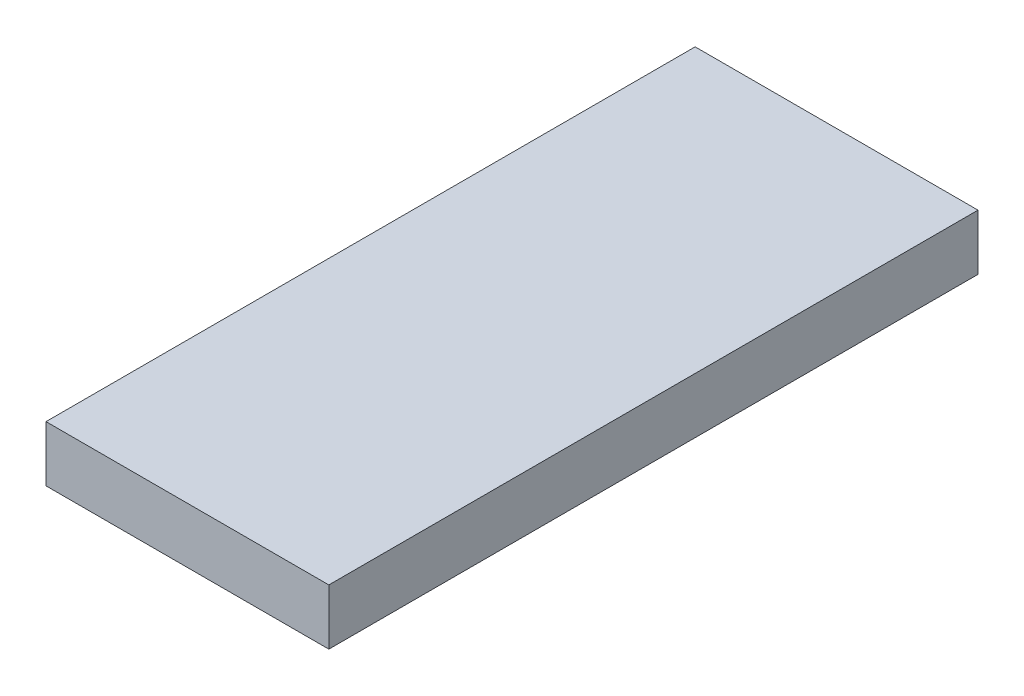
ISO-10303-21;
HEADER;
FILE_DESCRIPTION(('STEP AP214'),'2;1');
FILE_NAME('part.step','',(''),(''),'','','');
FILE_SCHEMA(('AUTOMOTIVE_DESIGN { 1 0 10303 214 1 1 1 1 }'));
ENDSEC;
DATA;
#1=APPLICATION_CONTEXT('core data for automotive mechanical design processes');
#2=APPLICATION_PROTOCOL_DEFINITION('international standard','automotive_design',2000,#1);
#3=PRODUCT_CONTEXT('',#1,'mechanical');
#4=PRODUCT('Part','Part','',(#3));
#5=PRODUCT_RELATED_PRODUCT_CATEGORY('part','',(#4));
#6=PRODUCT_DEFINITION_FORMATION('','',#4);
#7=PRODUCT_DEFINITION_CONTEXT('part definition',#1,'design');
#8=PRODUCT_DEFINITION('design','',#6,#7);
#9=PRODUCT_DEFINITION_SHAPE('','',#8);
#10=(LENGTH_UNIT() NAMED_UNIT(*) SI_UNIT(.MILLI.,.METRE.));
#11=(NAMED_UNIT(*) PLANE_ANGLE_UNIT() SI_UNIT($,.RADIAN.));
#12=(NAMED_UNIT(*) SI_UNIT($,.STERADIAN.) SOLID_ANGLE_UNIT());
#13=UNCERTAINTY_MEASURE_WITH_UNIT(LENGTH_MEASURE(1.E-05),#10,'distance_accuracy_value','');
#14=(GEOMETRIC_REPRESENTATION_CONTEXT(3) GLOBAL_UNCERTAINTY_ASSIGNED_CONTEXT((#13)) GLOBAL_UNIT_ASSIGNED_CONTEXT((#10,
#11,#12)) REPRESENTATION_CONTEXT('',''));
#15=CARTESIAN_POINT('',(0.,0.,0.));
#16=DIRECTION('',(0.,0.,1.));
#17=DIRECTION('',(1.,0.,0.));
#18=AXIS2_PLACEMENT_3D('',#15,#16,#17);
#19=CARTESIAN_POINT('',(26.05,2.05,-23.05));
#20=DIRECTION('',(0.,1.,0.));
#21=DIRECTION('',(0.,0.,1.));
#22=AXIS2_PLACEMENT_3D('',#19,#20,#21);
#23=PLANE('',#22);
#24=DIRECTION('',(-1.,0.,0.));
#25=VECTOR('',#24,1.);
#26=CARTESIAN_POINT('',(29.1,2.05,-9.05));
#27=LINE('',#26,#25);
#28=CARTESIAN_POINT('',(32.15,2.05,-9.05));
#29=VERTEX_POINT('',#28);
#30=CARTESIAN_POINT('',(26.05,2.05,-9.05));
#31=VERTEX_POINT('',#30);
#32=EDGE_CURVE('E54',#29,#31,#27,.T.);
#33=ORIENTED_EDGE('',*,*,#32,.F.);
#34=DIRECTION('',(0.,0.,1.));
#35=VECTOR('',#34,1.);
#36=CARTESIAN_POINT('',(32.15,2.05,-16.05));
#37=LINE('',#36,#35);
#38=CARTESIAN_POINT('',(32.15,2.05,-23.05));
#39=VERTEX_POINT('',#38);
#40=EDGE_CURVE('E69',#39,#29,#37,.T.);
#41=ORIENTED_EDGE('',*,*,#40,.F.);
#42=DIRECTION('',(1.,0.,0.));
#43=VECTOR('',#42,1.);
#44=CARTESIAN_POINT('',(29.1,2.05,-23.05));
#45=LINE('',#44,#43);
#46=CARTESIAN_POINT('',(26.05,2.05,-23.05));
#47=VERTEX_POINT('',#46);
#48=EDGE_CURVE('E21',#47,#39,#45,.T.);
#49=ORIENTED_EDGE('',*,*,#48,.F.);
#50=DIRECTION('',(0.,0.,-1.));
#51=VECTOR('',#50,1.);
#52=CARTESIAN_POINT('',(26.05,2.05,-16.05));
#53=LINE('',#52,#51);
#54=EDGE_CURVE('E59',#31,#47,#53,.T.);
#55=ORIENTED_EDGE('',*,*,#54,.F.);
#56=EDGE_LOOP('',(#33,#41,#49,#55));
#57=FACE_BOUND('',#56,.T.);
#58=ADVANCED_FACE('F17',(#57),#23,.T.);
#59=CARTESIAN_POINT('',(32.15,0.85,-23.05));
#60=DIRECTION('',(0.,0.,-1.));
#61=DIRECTION('',(-1.,0.,0.));
#62=AXIS2_PLACEMENT_3D('',#59,#60,#61);
#63=PLANE('',#62);
#64=ORIENTED_EDGE('',*,*,#48,.T.);
#65=DIRECTION('',(0.,1.,0.));
#66=VECTOR('',#65,1.);
#67=CARTESIAN_POINT('',(32.15,1.45,-23.05));
#68=LINE('',#67,#66);
#69=CARTESIAN_POINT('',(32.15,0.85,-23.05));
#70=VERTEX_POINT('',#69);
#71=EDGE_CURVE('E80',#70,#39,#68,.T.);
#72=ORIENTED_EDGE('',*,*,#71,.F.);
#73=DIRECTION('',(-1.,0.,0.));
#74=VECTOR('',#73,1.);
#75=CARTESIAN_POINT('',(29.1,0.85,-23.05));
#76=LINE('',#75,#74);
#77=CARTESIAN_POINT('',(26.05,0.85,-23.05));
#78=VERTEX_POINT('',#77);
#79=EDGE_CURVE('E75',#70,#78,#76,.T.);
#80=ORIENTED_EDGE('',*,*,#79,.T.);
#81=DIRECTION('',(0.,-1.,0.));
#82=VECTOR('',#81,1.);
#83=CARTESIAN_POINT('',(26.05,1.45,-23.05));
#84=LINE('',#83,#82);
#85=EDGE_CURVE('E64',#47,#78,#84,.T.);
#86=ORIENTED_EDGE('',*,*,#85,.F.);
#87=EDGE_LOOP('',(#64,#72,#80,#86));
#88=FACE_BOUND('',#87,.T.);
#89=ADVANCED_FACE('F74',(#88),#63,.T.);
#90=CARTESIAN_POINT('',(26.05,0.85,-23.05));
#91=DIRECTION('',(-1.,0.,0.));
#92=DIRECTION('',(0.,0.,1.));
#93=AXIS2_PLACEMENT_3D('',#90,#91,#92);
#94=PLANE('',#93);
#95=ORIENTED_EDGE('',*,*,#54,.T.);
#96=ORIENTED_EDGE('',*,*,#85,.T.);
#97=DIRECTION('',(0.,0.,1.));
#98=VECTOR('',#97,1.);
#99=CARTESIAN_POINT('',(26.05,0.85,-16.05));
#100=LINE('',#99,#98);
#101=CARTESIAN_POINT('',(26.05,0.85,-9.05));
#102=VERTEX_POINT('',#101);
#103=EDGE_CURVE('E85',#78,#102,#100,.T.);
#104=ORIENTED_EDGE('',*,*,#103,.T.);
#105=DIRECTION('',(0.,-1.,0.));
#106=VECTOR('',#105,1.);
#107=CARTESIAN_POINT('',(26.05,1.45,-9.05));
#108=LINE('',#107,#106);
#109=EDGE_CURVE('E66',#31,#102,#108,.T.);
#110=ORIENTED_EDGE('',*,*,#109,.F.);
#111=EDGE_LOOP('',(#95,#96,#104,#110));
#112=FACE_BOUND('',#111,.T.);
#113=ADVANCED_FACE('F61',(#112),#94,.T.);
#114=CARTESIAN_POINT('',(26.05,0.85,-9.05));
#115=DIRECTION('',(0.,0.,1.));
#116=DIRECTION('',(1.,0.,0.));
#117=AXIS2_PLACEMENT_3D('',#114,#115,#116);
#118=PLANE('',#117);
#119=ORIENTED_EDGE('',*,*,#32,.T.);
#120=ORIENTED_EDGE('',*,*,#109,.T.);
#121=DIRECTION('',(1.,0.,0.));
#122=VECTOR('',#121,1.);
#123=CARTESIAN_POINT('',(29.1,0.85,-9.05));
#124=LINE('',#123,#122);
#125=CARTESIAN_POINT('',(32.15,0.85,-9.05));
#126=VERTEX_POINT('',#125);
#127=EDGE_CURVE('E27',#102,#126,#124,.T.);
#128=ORIENTED_EDGE('',*,*,#127,.T.);
#129=DIRECTION('',(0.,-1.,0.));
#130=VECTOR('',#129,1.);
#131=CARTESIAN_POINT('',(32.15,1.45,-9.05));
#132=LINE('',#131,#130);
#133=EDGE_CURVE('E35',#29,#126,#132,.T.);
#134=ORIENTED_EDGE('',*,*,#133,.F.);
#135=EDGE_LOOP('',(#119,#120,#128,#134));
#136=FACE_BOUND('',#135,.T.);
#137=ADVANCED_FACE('F89',(#136),#118,.T.);
#138=CARTESIAN_POINT('',(32.15,0.85,-9.05));
#139=DIRECTION('',(1.,0.,0.));
#140=DIRECTION('',(0.,0.,-1.));
#141=AXIS2_PLACEMENT_3D('',#138,#139,#140);
#142=PLANE('',#141);
#143=ORIENTED_EDGE('',*,*,#40,.T.);
#144=ORIENTED_EDGE('',*,*,#133,.T.);
#145=DIRECTION('',(0.,0.,-1.));
#146=VECTOR('',#145,1.);
#147=CARTESIAN_POINT('',(32.15,0.85,-16.05));
#148=LINE('',#147,#146);
#149=EDGE_CURVE('E11',#126,#70,#148,.T.);
#150=ORIENTED_EDGE('',*,*,#149,.T.);
#151=ORIENTED_EDGE('',*,*,#71,.T.);
#152=EDGE_LOOP('',(#143,#144,#150,#151));
#153=FACE_BOUND('',#152,.T.);
#154=ADVANCED_FACE('F91',(#153),#142,.T.);
#155=CARTESIAN_POINT('',(26.05,0.85,-23.05));
#156=DIRECTION('',(0.,1.,0.));
#157=DIRECTION('',(0.,0.,1.));
#158=AXIS2_PLACEMENT_3D('',#155,#156,#157);
#159=PLANE('',#158);
#160=ORIENTED_EDGE('',*,*,#127,.F.);
#161=ORIENTED_EDGE('',*,*,#103,.F.);
#162=ORIENTED_EDGE('',*,*,#79,.F.);
#163=ORIENTED_EDGE('',*,*,#149,.F.);
#164=EDGE_LOOP('',(#160,#161,#162,#163));
#165=FACE_BOUND('',#164,.T.);
#166=ADVANCED_FACE('F19',(#165),#159,.F.);
#167=CLOSED_SHELL('',(#58,#89,#113,#137,#154,#166));
#168=MANIFOLD_SOLID_BREP('B1',#167);
#169=ADVANCED_BREP_SHAPE_REPRESENTATION('',(#18,#168),#14);
#170=SHAPE_DEFINITION_REPRESENTATION(#9,#169);
ENDSEC;
END-ISO-10303-21;
